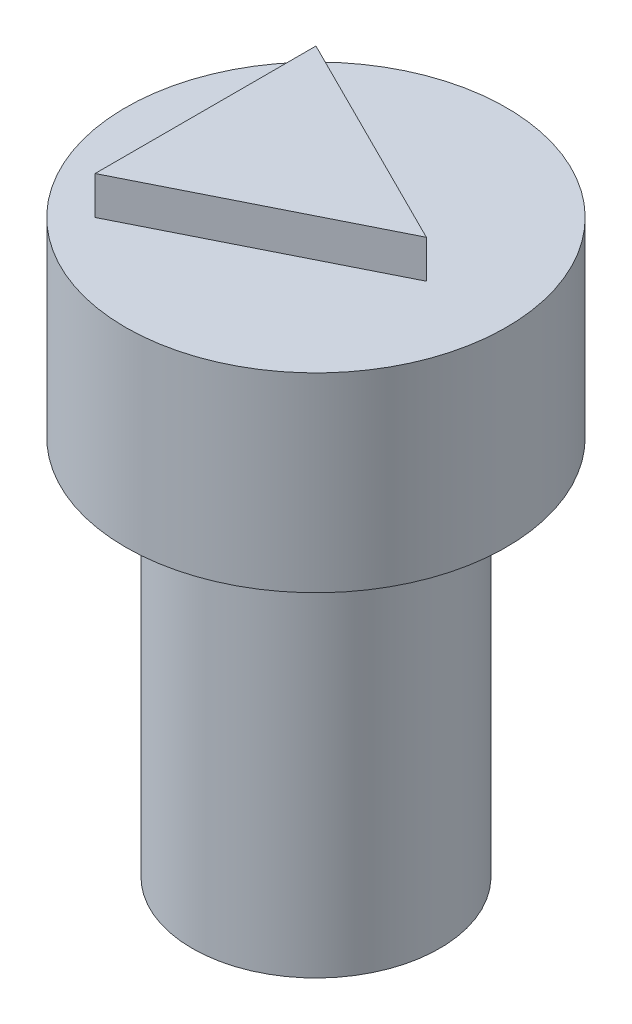
ISO-10303-21;
HEADER;
FILE_DESCRIPTION(('STEP AP214'),'2;1');
FILE_NAME('part.step','',(''),(''),'','','');
FILE_SCHEMA(('AUTOMOTIVE_DESIGN { 1 0 10303 214 1 1 1 1 }'));
ENDSEC;
DATA;
#1=APPLICATION_CONTEXT('core data for automotive mechanical design processes');
#2=APPLICATION_PROTOCOL_DEFINITION('international standard','automotive_design',2000,#1);
#3=PRODUCT_CONTEXT('',#1,'mechanical');
#4=PRODUCT('Part','Part','',(#3));
#5=PRODUCT_RELATED_PRODUCT_CATEGORY('part','',(#4));
#6=PRODUCT_DEFINITION_FORMATION('','',#4);
#7=PRODUCT_DEFINITION_CONTEXT('part definition',#1,'design');
#8=PRODUCT_DEFINITION('design','',#6,#7);
#9=PRODUCT_DEFINITION_SHAPE('','',#8);
#10=(LENGTH_UNIT() NAMED_UNIT(*) SI_UNIT(.MILLI.,.METRE.));
#11=(NAMED_UNIT(*) PLANE_ANGLE_UNIT() SI_UNIT($,.RADIAN.));
#12=(NAMED_UNIT(*) SI_UNIT($,.STERADIAN.) SOLID_ANGLE_UNIT());
#13=UNCERTAINTY_MEASURE_WITH_UNIT(LENGTH_MEASURE(1.E-05),#10,'distance_accuracy_value','');
#14=(GEOMETRIC_REPRESENTATION_CONTEXT(3) GLOBAL_UNCERTAINTY_ASSIGNED_CONTEXT((#13)) GLOBAL_UNIT_ASSIGNED_CONTEXT((#10,
#11,#12)) REPRESENTATION_CONTEXT('',''));
#15=CARTESIAN_POINT('',(0.,0.,0.));
#16=DIRECTION('',(0.,0.,1.));
#17=DIRECTION('',(1.,0.,0.));
#18=AXIS2_PLACEMENT_3D('',#15,#16,#17);
#19=CARTESIAN_POINT('',(0.,10.,0.));
#20=DIRECTION('',(0.,-1.,0.));
#21=DIRECTION('',(0.,0.,-1.));
#22=AXIS2_PLACEMENT_3D('',#19,#20,#21);
#23=CYLINDRICAL_SURFACE('',#22,3.25);
#24=CARTESIAN_POINT('',(0.,10.,0.));
#25=DIRECTION('',(0.,1.,0.));
#26=DIRECTION('',(0.,0.,1.));
#27=AXIS2_PLACEMENT_3D('',#24,#25,#26);
#28=CIRCLE('',#27,3.25);
#29=CARTESIAN_POINT('',(0.,10.,3.25));
#30=VERTEX_POINT('',#29);
#31=EDGE_CURVE('E11',#30,#30,#28,.T.);
#32=ORIENTED_EDGE('',*,*,#31,.F.);
#33=EDGE_LOOP('',(#32));
#34=FACE_BOUND('',#33,.T.);
#35=CARTESIAN_POINT('',(0.,0.,0.));
#36=DIRECTION('',(0.,1.,0.));
#37=DIRECTION('',(0.,0.,1.));
#38=AXIS2_PLACEMENT_3D('',#35,#36,#37);
#39=CIRCLE('',#38,3.25);
#40=CARTESIAN_POINT('',(0.,0.,3.25));
#41=VERTEX_POINT('',#40);
#42=EDGE_CURVE('E50',#41,#41,#39,.T.);
#43=ORIENTED_EDGE('',*,*,#42,.T.);
#44=EDGE_LOOP('',(#43));
#45=FACE_BOUND('',#44,.T.);
#46=ADVANCED_FACE('F47',(#34,#45),#23,.T.);
#47=CARTESIAN_POINT('',(0.,0.,0.));
#48=DIRECTION('',(0.,1.,0.));
#49=DIRECTION('',(0.,0.,1.));
#50=AXIS2_PLACEMENT_3D('',#47,#48,#49);
#51=PLANE('',#50);
#52=CARTESIAN_POINT('',(0.,0.,0.));
#53=DIRECTION('',(0.,-1.,0.));
#54=DIRECTION('',(0.,0.,-1.));
#55=AXIS2_PLACEMENT_3D('',#52,#53,#54);
#56=CIRCLE('',#55,1.75);
#57=CARTESIAN_POINT('',(0.,0.,-1.75));
#58=VERTEX_POINT('',#57);
#59=EDGE_CURVE('E116',#58,#58,#56,.T.);
#60=ORIENTED_EDGE('',*,*,#59,.F.);
#61=EDGE_LOOP('',(#60));
#62=FACE_BOUND('',#61,.T.);
#63=ORIENTED_EDGE('',*,*,#42,.F.);
#64=EDGE_LOOP('',(#63));
#65=FACE_BOUND('',#64,.T.);
#66=ADVANCED_FACE('F128',(#62,#65),#51,.F.);
#67=CARTESIAN_POINT('',(0.,2.5,0.));
#68=DIRECTION('',(0.,-1.,0.));
#69=DIRECTION('',(0.,0.,-1.));
#70=AXIS2_PLACEMENT_3D('',#67,#68,#69);
#71=CYLINDRICAL_SURFACE('',#70,1.75);
#72=CARTESIAN_POINT('',(0.,2.5,0.));
#73=DIRECTION('',(0.,-1.,0.));
#74=DIRECTION('',(0.,0.,-1.));
#75=AXIS2_PLACEMENT_3D('',#72,#73,#74);
#76=CIRCLE('',#75,1.75);
#77=CARTESIAN_POINT('',(0.,2.5,-1.75));
#78=VERTEX_POINT('',#77);
#79=EDGE_CURVE('E118',#78,#78,#76,.T.);
#80=ORIENTED_EDGE('',*,*,#79,.F.);
#81=EDGE_LOOP('',(#80));
#82=FACE_BOUND('',#81,.T.);
#83=ORIENTED_EDGE('',*,*,#59,.T.);
#84=EDGE_LOOP('',(#83));
#85=FACE_BOUND('',#84,.T.);
#86=ADVANCED_FACE('F126',(#82,#85),#71,.F.);
#87=CARTESIAN_POINT('',(0.,2.5,0.));
#88=DIRECTION('',(0.,-1.,0.));
#89=DIRECTION('',(0.,0.,-1.));
#90=AXIS2_PLACEMENT_3D('',#87,#88,#89);
#91=PLANE('',#90);
#92=ORIENTED_EDGE('',*,*,#79,.T.);
#93=EDGE_LOOP('',(#92));
#94=FACE_BOUND('',#93,.T.);
#95=ADVANCED_FACE('F149',(#94),#91,.T.);
#96=CARTESIAN_POINT('',(0.,15.,0.));
#97=DIRECTION('',(0.,-1.,0.));
#98=DIRECTION('',(0.,0.,-1.));
#99=AXIS2_PLACEMENT_3D('',#96,#97,#98);
#100=CYLINDRICAL_SURFACE('',#99,5.);
#101=CARTESIAN_POINT('',(0.,15.,0.));
#102=DIRECTION('',(0.,1.,0.));
#103=DIRECTION('',(0.,0.,1.));
#104=AXIS2_PLACEMENT_3D('',#101,#102,#103);
#105=CIRCLE('',#104,5.);
#106=CARTESIAN_POINT('',(0.,15.,5.));
#107=VERTEX_POINT('',#106);
#108=EDGE_CURVE('E108',#107,#107,#105,.T.);
#109=ORIENTED_EDGE('',*,*,#108,.F.);
#110=EDGE_LOOP('',(#109));
#111=FACE_BOUND('',#110,.T.);
#112=CARTESIAN_POINT('',(0.,10.,0.));
#113=DIRECTION('',(0.,1.,0.));
#114=DIRECTION('',(0.,0.,1.));
#115=AXIS2_PLACEMENT_3D('',#112,#113,#114);
#116=CIRCLE('',#115,5.);
#117=CARTESIAN_POINT('',(0.,10.,5.));
#118=VERTEX_POINT('',#117);
#119=EDGE_CURVE('E103',#118,#118,#116,.T.);
#120=ORIENTED_EDGE('',*,*,#119,.T.);
#121=EDGE_LOOP('',(#120));
#122=FACE_BOUND('',#121,.T.);
#123=ADVANCED_FACE('F147',(#111,#122),#100,.T.);
#124=CARTESIAN_POINT('',(0.,15.,0.));
#125=DIRECTION('',(0.,1.,0.));
#126=DIRECTION('',(0.,0.,1.));
#127=AXIS2_PLACEMENT_3D('',#124,#125,#126);
#128=PLANE('',#127);
#129=DIRECTION('',(-0.894427190999916,0.,-0.447213595499958));
#130=VECTOR('',#129,1.);
#131=CARTESIAN_POINT('',(2.9,15.,0.));
#132=LINE('',#131,#130);
#133=CARTESIAN_POINT('',(2.9,15.,0.));
#134=VERTEX_POINT('',#133);
#135=CARTESIAN_POINT('',(-2.9,15.,-2.9));
#136=VERTEX_POINT('',#135);
#137=EDGE_CURVE('E62',#134,#136,#132,.T.);
#138=ORIENTED_EDGE('',*,*,#137,.F.);
#139=DIRECTION('',(0.894427190999916,0.,-0.447213595499958));
#140=VECTOR('',#139,1.);
#141=CARTESIAN_POINT('',(-2.9,15.,2.9));
#142=LINE('',#141,#140);
#143=CARTESIAN_POINT('',(-2.9,15.,2.9));
#144=VERTEX_POINT('',#143);
#145=EDGE_CURVE('E99',#144,#134,#142,.T.);
#146=ORIENTED_EDGE('',*,*,#145,.F.);
#147=DIRECTION('',(0.,0.,1.));
#148=VECTOR('',#147,1.);
#149=CARTESIAN_POINT('',(-2.9,15.,-2.9));
#150=LINE('',#149,#148);
#151=EDGE_CURVE('E66',#136,#144,#150,.T.);
#152=ORIENTED_EDGE('',*,*,#151,.F.);
#153=EDGE_LOOP('',(#138,#146,#152));
#154=FACE_BOUND('',#153,.T.);
#155=ORIENTED_EDGE('',*,*,#108,.T.);
#156=EDGE_LOOP('',(#155));
#157=FACE_BOUND('',#156,.T.);
#158=ADVANCED_FACE('F143',(#154,#157),#128,.T.);
#159=CARTESIAN_POINT('',(0.,10.,0.));
#160=DIRECTION('',(0.,1.,0.));
#161=DIRECTION('',(0.,0.,1.));
#162=AXIS2_PLACEMENT_3D('',#159,#160,#161);
#163=PLANE('',#162);
#164=ORIENTED_EDGE('',*,*,#31,.T.);
#165=EDGE_LOOP('',(#164));
#166=FACE_BOUND('',#165,.T.);
#167=ORIENTED_EDGE('',*,*,#119,.F.);
#168=EDGE_LOOP('',(#167));
#169=FACE_BOUND('',#168,.T.);
#170=ADVANCED_FACE('F140',(#166,#169),#163,.F.);
#171=CARTESIAN_POINT('',(2.9,16.,0.));
#172=DIRECTION('',(-0.447213595499958,0.,0.894427190999916));
#173=DIRECTION('',(0.894427190999916,0.,0.447213595499958));
#174=AXIS2_PLACEMENT_3D('',#171,#172,#173);
#175=PLANE('',#174);
#176=ORIENTED_EDGE('',*,*,#137,.T.);
#177=DIRECTION('',(0.,-1.,0.));
#178=VECTOR('',#177,1.);
#179=CARTESIAN_POINT('',(-2.9,16.,-2.9));
#180=LINE('',#179,#178);
#181=CARTESIAN_POINT('',(-2.9,16.,-2.9));
#182=VERTEX_POINT('',#181);
#183=EDGE_CURVE('E84',#182,#136,#180,.T.);
#184=ORIENTED_EDGE('',*,*,#183,.F.);
#185=DIRECTION('',(-0.894427190999916,0.,-0.447213595499958));
#186=VECTOR('',#185,1.);
#187=CARTESIAN_POINT('',(2.9,16.,0.));
#188=LINE('',#187,#186);
#189=CARTESIAN_POINT('',(2.9,16.,0.));
#190=VERTEX_POINT('',#189);
#191=EDGE_CURVE('E91',#190,#182,#188,.T.);
#192=ORIENTED_EDGE('',*,*,#191,.F.);
#193=DIRECTION('',(0.,-1.,0.));
#194=VECTOR('',#193,1.);
#195=CARTESIAN_POINT('',(2.9,16.,0.));
#196=LINE('',#195,#194);
#197=EDGE_CURVE('E110',#190,#134,#196,.T.);
#198=ORIENTED_EDGE('',*,*,#197,.T.);
#199=EDGE_LOOP('',(#176,#184,#192,#198));
#200=FACE_BOUND('',#199,.T.);
#201=ADVANCED_FACE('F101',(#200),#175,.F.);
#202=CARTESIAN_POINT('',(-2.9,16.,-2.9));
#203=DIRECTION('',(1.,0.,0.));
#204=DIRECTION('',(0.,0.,-1.));
#205=AXIS2_PLACEMENT_3D('',#202,#203,#204);
#206=PLANE('',#205);
#207=ORIENTED_EDGE('',*,*,#151,.T.);
#208=DIRECTION('',(0.,-1.,0.));
#209=VECTOR('',#208,1.);
#210=CARTESIAN_POINT('',(-2.9,16.,2.9));
#211=LINE('',#210,#209);
#212=CARTESIAN_POINT('',(-2.9,16.,2.9));
#213=VERTEX_POINT('',#212);
#214=EDGE_CURVE('E86',#213,#144,#211,.T.);
#215=ORIENTED_EDGE('',*,*,#214,.F.);
#216=DIRECTION('',(0.,0.,1.));
#217=VECTOR('',#216,1.);
#218=CARTESIAN_POINT('',(-2.9,16.,-2.9));
#219=LINE('',#218,#217);
#220=EDGE_CURVE('E80',#182,#213,#219,.T.);
#221=ORIENTED_EDGE('',*,*,#220,.F.);
#222=ORIENTED_EDGE('',*,*,#183,.T.);
#223=EDGE_LOOP('',(#207,#215,#221,#222));
#224=FACE_BOUND('',#223,.T.);
#225=ADVANCED_FACE('F82',(#224),#206,.F.);
#226=CARTESIAN_POINT('',(-2.9,16.,2.9));
#227=DIRECTION('',(-0.447213595499958,0.,-0.894427190999916));
#228=DIRECTION('',(-0.894427190999916,0.,0.447213595499958));
#229=AXIS2_PLACEMENT_3D('',#226,#227,#228);
#230=PLANE('',#229);
#231=ORIENTED_EDGE('',*,*,#145,.T.);
#232=ORIENTED_EDGE('',*,*,#197,.F.);
#233=DIRECTION('',(0.894427190999916,0.,-0.447213595499958));
#234=VECTOR('',#233,1.);
#235=CARTESIAN_POINT('',(-2.9,16.,2.9));
#236=LINE('',#235,#234);
#237=EDGE_CURVE('E90',#213,#190,#236,.T.);
#238=ORIENTED_EDGE('',*,*,#237,.F.);
#239=ORIENTED_EDGE('',*,*,#214,.T.);
#240=EDGE_LOOP('',(#231,#232,#238,#239));
#241=FACE_BOUND('',#240,.T.);
#242=ADVANCED_FACE('F208',(#241),#230,.F.);
#243=CARTESIAN_POINT('',(0.,16.,0.));
#244=DIRECTION('',(0.,1.,0.));
#245=DIRECTION('',(0.,0.,1.));
#246=AXIS2_PLACEMENT_3D('',#243,#244,#245);
#247=PLANE('',#246);
#248=ORIENTED_EDGE('',*,*,#191,.T.);
#249=ORIENTED_EDGE('',*,*,#220,.T.);
#250=ORIENTED_EDGE('',*,*,#237,.T.);
#251=EDGE_LOOP('',(#248,#249,#250));
#252=FACE_BOUND('',#251,.T.);
#253=ADVANCED_FACE('F94',(#252),#247,.T.);
#254=CLOSED_SHELL('',(#46,#66,#86,#95,#123,#158,#170,#201,#225,#242,#253));
#255=MANIFOLD_SOLID_BREP('B2',#254);
#256=ADVANCED_BREP_SHAPE_REPRESENTATION('',(#18,#255),#14);
#257=SHAPE_DEFINITION_REPRESENTATION(#9,#256);
ENDSEC;
END-ISO-10303-21;
